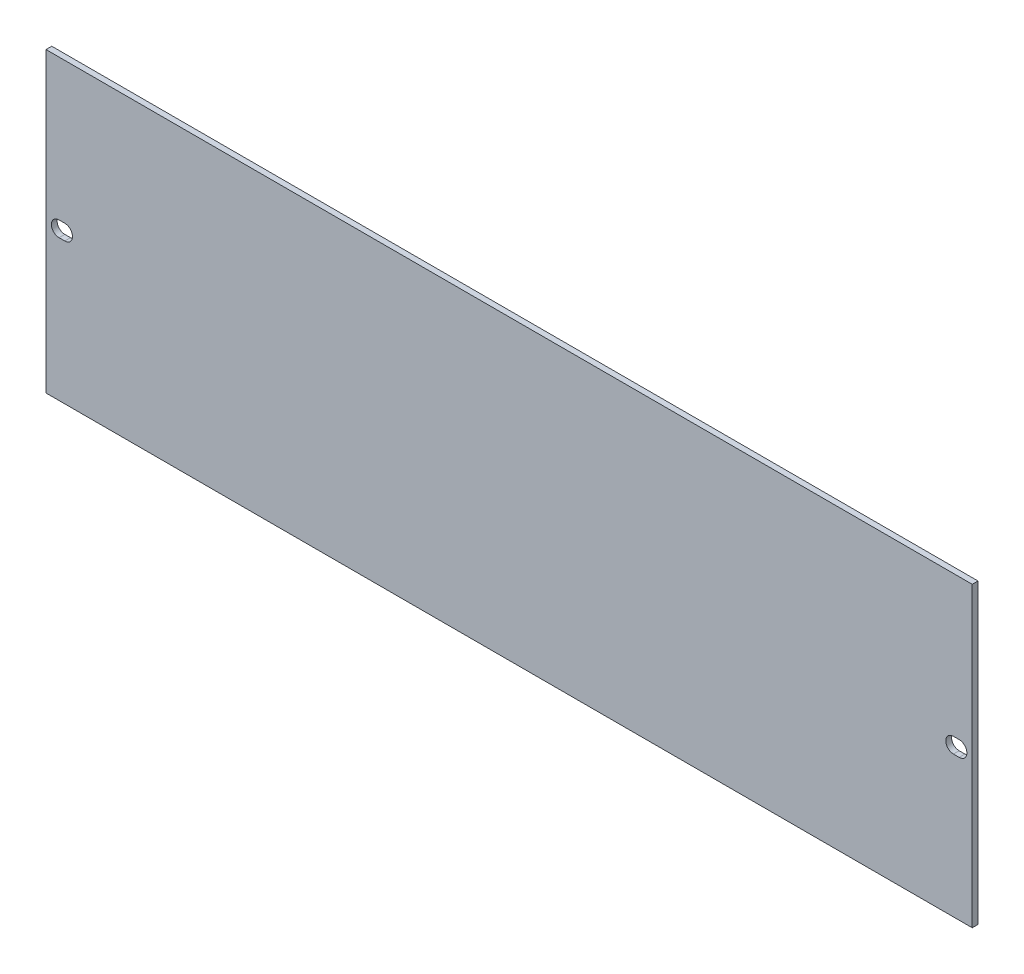
ISO-10303-21;
HEADER;
FILE_DESCRIPTION(('STEP AP214'),'2;1');
FILE_NAME('part.step','',(''),(''),'','','');
FILE_SCHEMA(('AUTOMOTIVE_DESIGN { 1 0 10303 214 1 1 1 1 }'));
ENDSEC;
DATA;
#1=APPLICATION_CONTEXT('core data for automotive mechanical design processes');
#2=APPLICATION_PROTOCOL_DEFINITION('international standard','automotive_design',2000,#1);
#3=PRODUCT_CONTEXT('',#1,'mechanical');
#4=PRODUCT('Part','Part','',(#3));
#5=PRODUCT_RELATED_PRODUCT_CATEGORY('part','',(#4));
#6=PRODUCT_DEFINITION_FORMATION('','',#4);
#7=PRODUCT_DEFINITION_CONTEXT('part definition',#1,'design');
#8=PRODUCT_DEFINITION('design','',#6,#7);
#9=PRODUCT_DEFINITION_SHAPE('','',#8);
#10=(LENGTH_UNIT() NAMED_UNIT(*) SI_UNIT(.MILLI.,.METRE.));
#11=(NAMED_UNIT(*) PLANE_ANGLE_UNIT() SI_UNIT($,.RADIAN.));
#12=(NAMED_UNIT(*) SI_UNIT($,.STERADIAN.) SOLID_ANGLE_UNIT());
#13=UNCERTAINTY_MEASURE_WITH_UNIT(LENGTH_MEASURE(1.E-05),#10,'distance_accuracy_value','');
#14=(GEOMETRIC_REPRESENTATION_CONTEXT(3) GLOBAL_UNCERTAINTY_ASSIGNED_CONTEXT((#13)) GLOBAL_UNIT_ASSIGNED_CONTEXT((#10,
#11,#12)) REPRESENTATION_CONTEXT('',''));
#15=CARTESIAN_POINT('',(0.,0.,0.));
#16=DIRECTION('',(0.,0.,1.));
#17=DIRECTION('',(1.,0.,0.));
#18=AXIS2_PLACEMENT_3D('',#15,#16,#17);
#19=CARTESIAN_POINT('',(0.,0.,3.));
#20=DIRECTION('',(0.,0.,1.));
#21=DIRECTION('',(1.,0.,0.));
#22=AXIS2_PLACEMENT_3D('',#19,#20,#21);
#23=PLANE('',#22);
#24=DIRECTION('',(0.,1.,0.));
#25=VECTOR('',#24,1.);
#26=CARTESIAN_POINT('',(241.3,77.5,3.));
#27=LINE('',#26,#25);
#28=CARTESIAN_POINT('',(241.3,-77.5,3.));
#29=VERTEX_POINT('',#28);
#30=CARTESIAN_POINT('',(241.3,77.5,3.));
#31=VERTEX_POINT('',#30);
#32=EDGE_CURVE('E193',#29,#31,#27,.T.);
#33=ORIENTED_EDGE('',*,*,#32,.T.);
#34=DIRECTION('',(-1.,0.,0.));
#35=VECTOR('',#34,1.);
#36=CARTESIAN_POINT('',(-241.3,77.5,3.));
#37=LINE('',#36,#35);
#38=CARTESIAN_POINT('',(-241.3,77.5,3.));
#39=VERTEX_POINT('',#38);
#40=EDGE_CURVE('E196',#31,#39,#37,.T.);
#41=ORIENTED_EDGE('',*,*,#40,.T.);
#42=DIRECTION('',(0.,-1.,0.));
#43=VECTOR('',#42,1.);
#44=CARTESIAN_POINT('',(-241.3,77.5,3.));
#45=LINE('',#44,#43);
#46=CARTESIAN_POINT('',(-241.3,-77.5,3.));
#47=VERTEX_POINT('',#46);
#48=EDGE_CURVE('E199',#39,#47,#45,.T.);
#49=ORIENTED_EDGE('',*,*,#48,.T.);
#50=DIRECTION('',(1.,0.,0.));
#51=VECTOR('',#50,1.);
#52=CARTESIAN_POINT('',(-241.3,-77.5,3.));
#53=LINE('',#52,#51);
#54=EDGE_CURVE('E201',#47,#29,#53,.T.);
#55=ORIENTED_EDGE('',*,*,#54,.T.);
#56=EDGE_LOOP('',(#33,#41,#49,#55));
#57=FACE_BOUND('',#56,.T.);
#58=DIRECTION('',(1.,0.,0.));
#59=VECTOR('',#58,1.);
#60=CARTESIAN_POINT('',(-234.5,-4.,3.));
#61=LINE('',#60,#59);
#62=CARTESIAN_POINT('',(-234.5,-4.,3.));
#63=VERTEX_POINT('',#62);
#64=CARTESIAN_POINT('',(-231.5,-4.,3.));
#65=VERTEX_POINT('',#64);
#66=EDGE_CURVE('E164',#63,#65,#61,.T.);
#67=ORIENTED_EDGE('',*,*,#66,.F.);
#68=CARTESIAN_POINT('',(-234.5,0.,3.));
#69=DIRECTION('',(0.,0.,1.));
#70=DIRECTION('',(1.,0.,0.));
#71=AXIS2_PLACEMENT_3D('',#68,#69,#70);
#72=CIRCLE('',#71,4.);
#73=CARTESIAN_POINT('',(-234.5,4.,3.));
#74=VERTEX_POINT('',#73);
#75=EDGE_CURVE('E162',#74,#63,#72,.T.);
#76=ORIENTED_EDGE('',*,*,#75,.F.);
#77=DIRECTION('',(-1.,0.,0.));
#78=VECTOR('',#77,1.);
#79=CARTESIAN_POINT('',(-234.5,4.,3.));
#80=LINE('',#79,#78);
#81=CARTESIAN_POINT('',(-231.5,4.,3.));
#82=VERTEX_POINT('',#81);
#83=EDGE_CURVE('E170',#82,#74,#80,.T.);
#84=ORIENTED_EDGE('',*,*,#83,.F.);
#85=CARTESIAN_POINT('',(-231.5,0.,3.));
#86=DIRECTION('',(0.,0.,1.));
#87=DIRECTION('',(1.,0.,0.));
#88=AXIS2_PLACEMENT_3D('',#85,#86,#87);
#89=CIRCLE('',#88,4.);
#90=EDGE_CURVE('E167',#65,#82,#89,.T.);
#91=ORIENTED_EDGE('',*,*,#90,.F.);
#92=EDGE_LOOP('',(#67,#76,#84,#91));
#93=FACE_BOUND('',#92,.T.);
#94=DIRECTION('',(-1.,0.,0.));
#95=VECTOR('',#94,1.);
#96=CARTESIAN_POINT('',(234.5,4.,3.));
#97=LINE('',#96,#95);
#98=CARTESIAN_POINT('',(234.5,4.,3.));
#99=VERTEX_POINT('',#98);
#100=CARTESIAN_POINT('',(231.5,4.,3.));
#101=VERTEX_POINT('',#100);
#102=EDGE_CURVE('E134',#99,#101,#97,.T.);
#103=ORIENTED_EDGE('',*,*,#102,.F.);
#104=CARTESIAN_POINT('',(234.5,0.,3.));
#105=DIRECTION('',(0.,0.,1.));
#106=DIRECTION('',(-1.,0.,0.));
#107=AXIS2_PLACEMENT_3D('',#104,#105,#106);
#108=CIRCLE('',#107,4.);
#109=CARTESIAN_POINT('',(234.5,-4.,3.));
#110=VERTEX_POINT('',#109);
#111=EDGE_CURVE('E126',#110,#99,#108,.T.);
#112=ORIENTED_EDGE('',*,*,#111,.F.);
#113=DIRECTION('',(1.,0.,0.));
#114=VECTOR('',#113,1.);
#115=CARTESIAN_POINT('',(234.5,-4.,3.));
#116=LINE('',#115,#114);
#117=CARTESIAN_POINT('',(231.5,-4.,3.));
#118=VERTEX_POINT('',#117);
#119=EDGE_CURVE('E148',#118,#110,#116,.T.);
#120=ORIENTED_EDGE('',*,*,#119,.F.);
#121=CARTESIAN_POINT('',(231.5,0.,3.));
#122=DIRECTION('',(0.,0.,1.));
#123=DIRECTION('',(-1.,0.,0.));
#124=AXIS2_PLACEMENT_3D('',#121,#122,#123);
#125=CIRCLE('',#124,4.);
#126=EDGE_CURVE('E146',#101,#118,#125,.T.);
#127=ORIENTED_EDGE('',*,*,#126,.F.);
#128=EDGE_LOOP('',(#103,#112,#120,#127));
#129=FACE_BOUND('',#128,.T.);
#130=ADVANCED_FACE('F37',(#57,#93,#129),#23,.T.);
#131=CARTESIAN_POINT('',(0.,0.,0.));
#132=DIRECTION('',(0.,0.,1.));
#133=DIRECTION('',(1.,0.,0.));
#134=AXIS2_PLACEMENT_3D('',#131,#132,#133);
#135=PLANE('',#134);
#136=CARTESIAN_POINT('',(-234.5,0.,0.));
#137=DIRECTION('',(0.,0.,1.));
#138=DIRECTION('',(1.,0.,0.));
#139=AXIS2_PLACEMENT_3D('',#136,#137,#138);
#140=CIRCLE('',#139,4.);
#141=CARTESIAN_POINT('',(-234.5,4.,0.));
#142=VERTEX_POINT('',#141);
#143=CARTESIAN_POINT('',(-234.5,-4.,0.));
#144=VERTEX_POINT('',#143);
#145=EDGE_CURVE('E142',#142,#144,#140,.T.);
#146=ORIENTED_EDGE('',*,*,#145,.T.);
#147=DIRECTION('',(1.,0.,0.));
#148=VECTOR('',#147,1.);
#149=CARTESIAN_POINT('',(-234.5,-4.,0.));
#150=LINE('',#149,#148);
#151=CARTESIAN_POINT('',(-231.5,-4.,0.));
#152=VERTEX_POINT('',#151);
#153=EDGE_CURVE('E175',#144,#152,#150,.T.);
#154=ORIENTED_EDGE('',*,*,#153,.T.);
#155=CARTESIAN_POINT('',(-231.5,0.,0.));
#156=DIRECTION('',(0.,0.,1.));
#157=DIRECTION('',(1.,0.,0.));
#158=AXIS2_PLACEMENT_3D('',#155,#156,#157);
#159=CIRCLE('',#158,4.);
#160=CARTESIAN_POINT('',(-231.5,4.,0.));
#161=VERTEX_POINT('',#160);
#162=EDGE_CURVE('E178',#152,#161,#159,.T.);
#163=ORIENTED_EDGE('',*,*,#162,.T.);
#164=DIRECTION('',(-1.,0.,0.));
#165=VECTOR('',#164,1.);
#166=CARTESIAN_POINT('',(-234.5,4.,0.));
#167=LINE('',#166,#165);
#168=EDGE_CURVE('E165',#161,#142,#167,.T.);
#169=ORIENTED_EDGE('',*,*,#168,.T.);
#170=EDGE_LOOP('',(#146,#154,#163,#169));
#171=FACE_BOUND('',#170,.T.);
#172=DIRECTION('',(0.,1.,0.));
#173=VECTOR('',#172,1.);
#174=CARTESIAN_POINT('',(241.3,77.5,0.));
#175=LINE('',#174,#173);
#176=CARTESIAN_POINT('',(241.3,-77.5,0.));
#177=VERTEX_POINT('',#176);
#178=CARTESIAN_POINT('',(241.3,77.5,0.));
#179=VERTEX_POINT('',#178);
#180=EDGE_CURVE('E192',#177,#179,#175,.T.);
#181=ORIENTED_EDGE('',*,*,#180,.F.);
#182=DIRECTION('',(1.,0.,0.));
#183=VECTOR('',#182,1.);
#184=CARTESIAN_POINT('',(-241.3,-77.5,0.));
#185=LINE('',#184,#183);
#186=CARTESIAN_POINT('',(-241.3,-77.5,0.));
#187=VERTEX_POINT('',#186);
#188=EDGE_CURVE('E197',#187,#177,#185,.T.);
#189=ORIENTED_EDGE('',*,*,#188,.F.);
#190=DIRECTION('',(0.,-1.,0.));
#191=VECTOR('',#190,1.);
#192=CARTESIAN_POINT('',(-241.3,77.5,0.));
#193=LINE('',#192,#191);
#194=CARTESIAN_POINT('',(-241.3,77.5,0.));
#195=VERTEX_POINT('',#194);
#196=EDGE_CURVE('E208',#195,#187,#193,.T.);
#197=ORIENTED_EDGE('',*,*,#196,.F.);
#198=DIRECTION('',(-1.,0.,0.));
#199=VECTOR('',#198,1.);
#200=CARTESIAN_POINT('',(-241.3,77.5,0.));
#201=LINE('',#200,#199);
#202=EDGE_CURVE('E206',#179,#195,#201,.T.);
#203=ORIENTED_EDGE('',*,*,#202,.F.);
#204=EDGE_LOOP('',(#181,#189,#197,#203));
#205=FACE_BOUND('',#204,.T.);
#206=CARTESIAN_POINT('',(234.5,0.,0.));
#207=DIRECTION('',(0.,0.,1.));
#208=DIRECTION('',(-1.,0.,0.));
#209=AXIS2_PLACEMENT_3D('',#206,#207,#208);
#210=CIRCLE('',#209,4.);
#211=CARTESIAN_POINT('',(234.5,-4.,0.));
#212=VERTEX_POINT('',#211);
#213=CARTESIAN_POINT('',(234.5,4.,0.));
#214=VERTEX_POINT('',#213);
#215=EDGE_CURVE('E60',#212,#214,#210,.T.);
#216=ORIENTED_EDGE('',*,*,#215,.T.);
#217=DIRECTION('',(-1.,0.,0.));
#218=VECTOR('',#217,1.);
#219=CARTESIAN_POINT('',(234.5,4.,0.));
#220=LINE('',#219,#218);
#221=CARTESIAN_POINT('',(231.5,4.,0.));
#222=VERTEX_POINT('',#221);
#223=EDGE_CURVE('E141',#214,#222,#220,.T.);
#224=ORIENTED_EDGE('',*,*,#223,.T.);
#225=CARTESIAN_POINT('',(231.5,0.,0.));
#226=DIRECTION('',(0.,0.,1.));
#227=DIRECTION('',(-1.,0.,0.));
#228=AXIS2_PLACEMENT_3D('',#225,#226,#227);
#229=CIRCLE('',#228,4.);
#230=CARTESIAN_POINT('',(231.5,-4.,0.));
#231=VERTEX_POINT('',#230);
#232=EDGE_CURVE('E154',#222,#231,#229,.T.);
#233=ORIENTED_EDGE('',*,*,#232,.T.);
#234=DIRECTION('',(1.,0.,0.));
#235=VECTOR('',#234,1.);
#236=CARTESIAN_POINT('',(234.5,-4.,0.));
#237=LINE('',#236,#235);
#238=EDGE_CURVE('E135',#231,#212,#237,.T.);
#239=ORIENTED_EDGE('',*,*,#238,.T.);
#240=EDGE_LOOP('',(#216,#224,#233,#239));
#241=FACE_BOUND('',#240,.T.);
#242=ADVANCED_FACE('F226',(#171,#205,#241),#135,.F.);
#243=CARTESIAN_POINT('',(241.3,77.5,3.));
#244=DIRECTION('',(-1.,0.,0.));
#245=DIRECTION('',(0.,0.,1.));
#246=AXIS2_PLACEMENT_3D('',#243,#244,#245);
#247=PLANE('',#246);
#248=ORIENTED_EDGE('',*,*,#180,.T.);
#249=DIRECTION('',(0.,0.,-1.));
#250=VECTOR('',#249,1.);
#251=CARTESIAN_POINT('',(241.3,77.5,3.));
#252=LINE('',#251,#250);
#253=EDGE_CURVE('E11',#31,#179,#252,.T.);
#254=ORIENTED_EDGE('',*,*,#253,.F.);
#255=ORIENTED_EDGE('',*,*,#32,.F.);
#256=DIRECTION('',(0.,0.,-1.));
#257=VECTOR('',#256,1.);
#258=CARTESIAN_POINT('',(241.3,-77.5,3.));
#259=LINE('',#258,#257);
#260=EDGE_CURVE('E203',#29,#177,#259,.T.);
#261=ORIENTED_EDGE('',*,*,#260,.T.);
#262=EDGE_LOOP('',(#248,#254,#255,#261));
#263=FACE_BOUND('',#262,.T.);
#264=ADVANCED_FACE('F39',(#263),#247,.F.);
#265=CARTESIAN_POINT('',(-241.3,77.5,3.));
#266=DIRECTION('',(0.,-1.,0.));
#267=DIRECTION('',(0.,0.,-1.));
#268=AXIS2_PLACEMENT_3D('',#265,#266,#267);
#269=PLANE('',#268);
#270=ORIENTED_EDGE('',*,*,#202,.T.);
#271=DIRECTION('',(0.,0.,-1.));
#272=VECTOR('',#271,1.);
#273=CARTESIAN_POINT('',(-241.3,77.5,3.));
#274=LINE('',#273,#272);
#275=EDGE_CURVE('E45',#39,#195,#274,.T.);
#276=ORIENTED_EDGE('',*,*,#275,.F.);
#277=ORIENTED_EDGE('',*,*,#40,.F.);
#278=ORIENTED_EDGE('',*,*,#253,.T.);
#279=EDGE_LOOP('',(#270,#276,#277,#278));
#280=FACE_BOUND('',#279,.T.);
#281=ADVANCED_FACE('F237',(#280),#269,.F.);
#282=CARTESIAN_POINT('',(-241.3,77.5,3.));
#283=DIRECTION('',(1.,0.,0.));
#284=DIRECTION('',(0.,0.,-1.));
#285=AXIS2_PLACEMENT_3D('',#282,#283,#284);
#286=PLANE('',#285);
#287=ORIENTED_EDGE('',*,*,#196,.T.);
#288=DIRECTION('',(0.,0.,-1.));
#289=VECTOR('',#288,1.);
#290=CARTESIAN_POINT('',(-241.3,-77.5,3.));
#291=LINE('',#290,#289);
#292=EDGE_CURVE('E213',#47,#187,#291,.T.);
#293=ORIENTED_EDGE('',*,*,#292,.F.);
#294=ORIENTED_EDGE('',*,*,#48,.F.);
#295=ORIENTED_EDGE('',*,*,#275,.T.);
#296=EDGE_LOOP('',(#287,#293,#294,#295));
#297=FACE_BOUND('',#296,.T.);
#298=ADVANCED_FACE('F220',(#297),#286,.F.);
#299=CARTESIAN_POINT('',(-241.3,-77.5,3.));
#300=DIRECTION('',(0.,1.,0.));
#301=DIRECTION('',(0.,0.,1.));
#302=AXIS2_PLACEMENT_3D('',#299,#300,#301);
#303=PLANE('',#302);
#304=ORIENTED_EDGE('',*,*,#188,.T.);
#305=ORIENTED_EDGE('',*,*,#260,.F.);
#306=ORIENTED_EDGE('',*,*,#54,.F.);
#307=ORIENTED_EDGE('',*,*,#292,.T.);
#308=EDGE_LOOP('',(#304,#305,#306,#307));
#309=FACE_BOUND('',#308,.T.);
#310=ADVANCED_FACE('F230',(#309),#303,.F.);
#311=CARTESIAN_POINT('',(-234.5,0.,3.));
#312=DIRECTION('',(0.,0.,-1.));
#313=DIRECTION('',(-1.,0.,0.));
#314=AXIS2_PLACEMENT_3D('',#311,#312,#313);
#315=CYLINDRICAL_SURFACE('',#314,4.);
#316=ORIENTED_EDGE('',*,*,#145,.F.);
#317=DIRECTION('',(0.,0.,-1.));
#318=VECTOR('',#317,1.);
#319=CARTESIAN_POINT('',(-234.5,4.,3.));
#320=LINE('',#319,#318);
#321=EDGE_CURVE('E172',#74,#142,#320,.T.);
#322=ORIENTED_EDGE('',*,*,#321,.F.);
#323=ORIENTED_EDGE('',*,*,#75,.T.);
#324=DIRECTION('',(0.,0.,-1.));
#325=VECTOR('',#324,1.);
#326=CARTESIAN_POINT('',(-234.5,-4.,3.));
#327=LINE('',#326,#325);
#328=EDGE_CURVE('E189',#63,#144,#327,.T.);
#329=ORIENTED_EDGE('',*,*,#328,.T.);
#330=EDGE_LOOP('',(#316,#322,#323,#329));
#331=FACE_BOUND('',#330,.T.);
#332=ADVANCED_FACE('F252',(#331),#315,.F.);
#333=CARTESIAN_POINT('',(-234.5,-4.,3.));
#334=DIRECTION('',(0.,1.,0.));
#335=DIRECTION('',(-1.,0.,0.));
#336=AXIS2_PLACEMENT_3D('',#333,#334,#335);
#337=PLANE('',#336);
#338=ORIENTED_EDGE('',*,*,#153,.F.);
#339=ORIENTED_EDGE('',*,*,#328,.F.);
#340=ORIENTED_EDGE('',*,*,#66,.T.);
#341=DIRECTION('',(0.,0.,-1.));
#342=VECTOR('',#341,1.);
#343=CARTESIAN_POINT('',(-231.5,-4.,3.));
#344=LINE('',#343,#342);
#345=EDGE_CURVE('E187',#65,#152,#344,.T.);
#346=ORIENTED_EDGE('',*,*,#345,.T.);
#347=EDGE_LOOP('',(#338,#339,#340,#346));
#348=FACE_BOUND('',#347,.T.);
#349=ADVANCED_FACE('F259',(#348),#337,.T.);
#350=CARTESIAN_POINT('',(-231.5,0.,3.));
#351=DIRECTION('',(0.,0.,-1.));
#352=DIRECTION('',(-1.,0.,0.));
#353=AXIS2_PLACEMENT_3D('',#350,#351,#352);
#354=CYLINDRICAL_SURFACE('',#353,4.);
#355=ORIENTED_EDGE('',*,*,#162,.F.);
#356=ORIENTED_EDGE('',*,*,#345,.F.);
#357=ORIENTED_EDGE('',*,*,#90,.T.);
#358=DIRECTION('',(0.,0.,-1.));
#359=VECTOR('',#358,1.);
#360=CARTESIAN_POINT('',(-231.5,4.,3.));
#361=LINE('',#360,#359);
#362=EDGE_CURVE('E185',#82,#161,#361,.T.);
#363=ORIENTED_EDGE('',*,*,#362,.T.);
#364=EDGE_LOOP('',(#355,#356,#357,#363));
#365=FACE_BOUND('',#364,.T.);
#366=ADVANCED_FACE('F264',(#365),#354,.F.);
#367=CARTESIAN_POINT('',(-234.5,4.,3.));
#368=DIRECTION('',(0.,-1.,0.));
#369=DIRECTION('',(1.,0.,0.));
#370=AXIS2_PLACEMENT_3D('',#367,#368,#369);
#371=PLANE('',#370);
#372=ORIENTED_EDGE('',*,*,#168,.F.);
#373=ORIENTED_EDGE('',*,*,#362,.F.);
#374=ORIENTED_EDGE('',*,*,#83,.T.);
#375=ORIENTED_EDGE('',*,*,#321,.T.);
#376=EDGE_LOOP('',(#372,#373,#374,#375));
#377=FACE_BOUND('',#376,.T.);
#378=ADVANCED_FACE('F271',(#377),#371,.T.);
#379=CARTESIAN_POINT('',(234.5,0.,3.));
#380=DIRECTION('',(0.,0.,-1.));
#381=DIRECTION('',(-1.,0.,0.));
#382=AXIS2_PLACEMENT_3D('',#379,#380,#381);
#383=CYLINDRICAL_SURFACE('',#382,4.);
#384=ORIENTED_EDGE('',*,*,#215,.F.);
#385=DIRECTION('',(0.,0.,-1.));
#386=VECTOR('',#385,1.);
#387=CARTESIAN_POINT('',(234.5,-4.,3.));
#388=LINE('',#387,#386);
#389=EDGE_CURVE('E130',#110,#212,#388,.T.);
#390=ORIENTED_EDGE('',*,*,#389,.F.);
#391=ORIENTED_EDGE('',*,*,#111,.T.);
#392=DIRECTION('',(0.,0.,-1.));
#393=VECTOR('',#392,1.);
#394=CARTESIAN_POINT('',(234.5,4.,3.));
#395=LINE('',#394,#393);
#396=EDGE_CURVE('E129',#99,#214,#395,.T.);
#397=ORIENTED_EDGE('',*,*,#396,.T.);
#398=EDGE_LOOP('',(#384,#390,#391,#397));
#399=FACE_BOUND('',#398,.T.);
#400=ADVANCED_FACE('F128',(#399),#383,.F.);
#401=CARTESIAN_POINT('',(234.5,4.,3.));
#402=DIRECTION('',(0.,-1.,0.));
#403=DIRECTION('',(1.,0.,0.));
#404=AXIS2_PLACEMENT_3D('',#401,#402,#403);
#405=PLANE('',#404);
#406=ORIENTED_EDGE('',*,*,#223,.F.);
#407=ORIENTED_EDGE('',*,*,#396,.F.);
#408=ORIENTED_EDGE('',*,*,#102,.T.);
#409=DIRECTION('',(0.,0.,-1.));
#410=VECTOR('',#409,1.);
#411=CARTESIAN_POINT('',(231.5,4.,3.));
#412=LINE('',#411,#410);
#413=EDGE_CURVE('E143',#101,#222,#412,.T.);
#414=ORIENTED_EDGE('',*,*,#413,.T.);
#415=EDGE_LOOP('',(#406,#407,#408,#414));
#416=FACE_BOUND('',#415,.T.);
#417=ADVANCED_FACE('F138',(#416),#405,.T.);
#418=CARTESIAN_POINT('',(231.5,0.,3.));
#419=DIRECTION('',(0.,0.,-1.));
#420=DIRECTION('',(-1.,0.,0.));
#421=AXIS2_PLACEMENT_3D('',#418,#419,#420);
#422=CYLINDRICAL_SURFACE('',#421,4.);
#423=ORIENTED_EDGE('',*,*,#232,.F.);
#424=ORIENTED_EDGE('',*,*,#413,.F.);
#425=ORIENTED_EDGE('',*,*,#126,.T.);
#426=DIRECTION('',(0.,0.,-1.));
#427=VECTOR('',#426,1.);
#428=CARTESIAN_POINT('',(231.5,-4.,3.));
#429=LINE('',#428,#427);
#430=EDGE_CURVE('E52',#118,#231,#429,.T.);
#431=ORIENTED_EDGE('',*,*,#430,.T.);
#432=EDGE_LOOP('',(#423,#424,#425,#431));
#433=FACE_BOUND('',#432,.T.);
#434=ADVANCED_FACE('F289',(#433),#422,.F.);
#435=CARTESIAN_POINT('',(234.5,-4.,3.));
#436=DIRECTION('',(0.,1.,0.));
#437=DIRECTION('',(-1.,0.,0.));
#438=AXIS2_PLACEMENT_3D('',#435,#436,#437);
#439=PLANE('',#438);
#440=ORIENTED_EDGE('',*,*,#238,.F.);
#441=ORIENTED_EDGE('',*,*,#430,.F.);
#442=ORIENTED_EDGE('',*,*,#119,.T.);
#443=ORIENTED_EDGE('',*,*,#389,.T.);
#444=EDGE_LOOP('',(#440,#441,#442,#443));
#445=FACE_BOUND('',#444,.T.);
#446=ADVANCED_FACE('F292',(#445),#439,.T.);
#447=CLOSED_SHELL('',(#130,#242,#264,#281,#298,#310,#332,#349,#366,#378,#400,#417,#434,#446));
#448=MANIFOLD_SOLID_BREP('B2',#447);
#449=ADVANCED_BREP_SHAPE_REPRESENTATION('',(#18,#448),#14);
#450=SHAPE_DEFINITION_REPRESENTATION(#9,#449);
ENDSEC;
END-ISO-10303-21;
